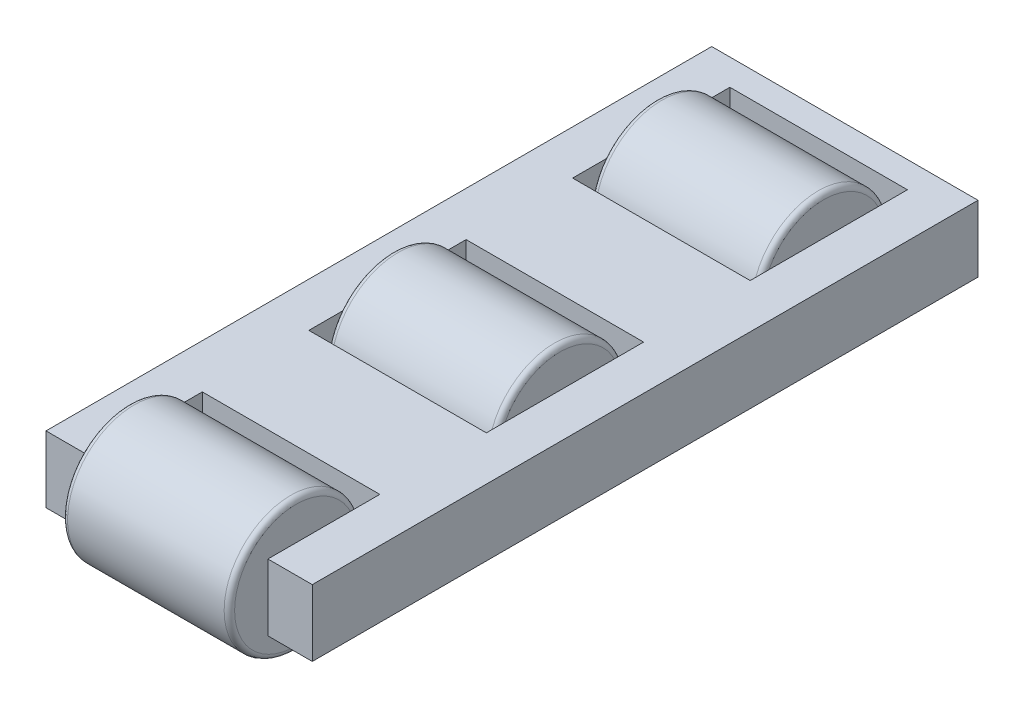
ISO-10303-21;
HEADER;
FILE_DESCRIPTION(('STEP AP214'),'2;1');
FILE_NAME('part.step','',(''),(''),'','','');
FILE_SCHEMA(('AUTOMOTIVE_DESIGN { 1 0 10303 214 1 1 1 1 }'));
ENDSEC;
DATA;
#1=APPLICATION_CONTEXT('core data for automotive mechanical design processes');
#2=APPLICATION_PROTOCOL_DEFINITION('international standard','automotive_design',2000,#1);
#3=PRODUCT_CONTEXT('',#1,'mechanical');
#4=PRODUCT('Part','Part','',(#3));
#5=PRODUCT_RELATED_PRODUCT_CATEGORY('part','',(#4));
#6=PRODUCT_DEFINITION_FORMATION('','',#4);
#7=PRODUCT_DEFINITION_CONTEXT('part definition',#1,'design');
#8=PRODUCT_DEFINITION('design','',#6,#7);
#9=PRODUCT_DEFINITION_SHAPE('','',#8);
#10=(LENGTH_UNIT() NAMED_UNIT(*) SI_UNIT(.MILLI.,.METRE.));
#11=(NAMED_UNIT(*) PLANE_ANGLE_UNIT() SI_UNIT($,.RADIAN.));
#12=(NAMED_UNIT(*) SI_UNIT($,.STERADIAN.) SOLID_ANGLE_UNIT());
#13=UNCERTAINTY_MEASURE_WITH_UNIT(LENGTH_MEASURE(1.E-05),#10,'distance_accuracy_value','');
#14=(GEOMETRIC_REPRESENTATION_CONTEXT(3) GLOBAL_UNCERTAINTY_ASSIGNED_CONTEXT((#13)) GLOBAL_UNIT_ASSIGNED_CONTEXT((#10,
#11,#12)) REPRESENTATION_CONTEXT('',''));
#15=CARTESIAN_POINT('',(0.,0.,0.));
#16=DIRECTION('',(0.,0.,1.));
#17=DIRECTION('',(1.,0.,0.));
#18=AXIS2_PLACEMENT_3D('',#15,#16,#17);
#19=CARTESIAN_POINT('',(15.9333333333333,6.35,57.15));
#20=DIRECTION('',(-1.,0.,0.));
#21=DIRECTION('',(0.,0.,1.));
#22=AXIS2_PLACEMENT_3D('',#19,#20,#21);
#23=PLANE('',#22);
#24=CARTESIAN_POINT('',(15.9333333333333,6.35,57.15));
#25=DIRECTION('',(-1.,0.,0.));
#26=DIRECTION('',(0.,0.,1.));
#27=AXIS2_PLACEMENT_3D('',#24,#25,#26);
#28=CIRCLE('',#27,11.7);
#29=CARTESIAN_POINT('',(15.9333333333333,6.35,68.85));
#30=VERTEX_POINT('',#29);
#31=EDGE_CURVE('E50',#30,#30,#28,.F.);
#32=ORIENTED_EDGE('',*,*,#31,.T.);
#33=EDGE_LOOP('',(#32));
#34=FACE_BOUND('',#33,.T.);
#35=ADVANCED_FACE('F43',(#34),#23,.F.);
#36=CARTESIAN_POINT('',(-51.85435781761,6.35,57.15));
#37=DIRECTION('',(1.,0.,0.));
#38=DIRECTION('',(0.,0.,-1.));
#39=AXIS2_PLACEMENT_3D('',#36,#37,#38);
#40=CYLINDRICAL_SURFACE('',#39,12.7);
#41=CARTESIAN_POINT('',(14.9333333333333,6.35,57.15));
#42=DIRECTION('',(-1.,0.,0.));
#43=DIRECTION('',(0.,0.,1.));
#44=AXIS2_PLACEMENT_3D('',#41,#42,#43);
#45=CIRCLE('',#44,12.7);
#46=CARTESIAN_POINT('',(14.9333333333333,6.35,69.85));
#47=VERTEX_POINT('',#46);
#48=EDGE_CURVE('E54',#47,#47,#45,.T.);
#49=ORIENTED_EDGE('',*,*,#48,.T.);
#50=EDGE_LOOP('',(#49));
#51=FACE_BOUND('',#50,.T.);
#52=CARTESIAN_POINT('',(-14.9333333333333,6.35,57.15));
#53=DIRECTION('',(1.,0.,0.));
#54=DIRECTION('',(0.,0.,-1.));
#55=AXIS2_PLACEMENT_3D('',#52,#53,#54);
#56=CIRCLE('',#55,12.7);
#57=CARTESIAN_POINT('',(-14.9333333333333,6.35,44.45));
#58=VERTEX_POINT('',#57);
#59=EDGE_CURVE('E58',#58,#58,#56,.T.);
#60=ORIENTED_EDGE('',*,*,#59,.T.);
#61=EDGE_LOOP('',(#60));
#62=FACE_BOUND('',#61,.T.);
#63=ADVANCED_FACE('F64',(#51,#62),#40,.T.);
#64=CARTESIAN_POINT('',(-15.9333333333333,0.,0.));
#65=DIRECTION('',(1.,0.,0.));
#66=DIRECTION('',(0.,0.,-1.));
#67=AXIS2_PLACEMENT_3D('',#64,#65,#66);
#68=PLANE('',#67);
#69=CARTESIAN_POINT('',(-15.9333333333333,6.35,57.15));
#70=DIRECTION('',(1.,0.,0.));
#71=DIRECTION('',(0.,0.,-1.));
#72=AXIS2_PLACEMENT_3D('',#69,#70,#71);
#73=CIRCLE('',#72,11.7);
#74=CARTESIAN_POINT('',(-15.9333333333333,6.35,45.45));
#75=VERTEX_POINT('',#74);
#76=EDGE_CURVE('E11',#75,#75,#73,.F.);
#77=ORIENTED_EDGE('',*,*,#76,.T.);
#78=EDGE_LOOP('',(#77));
#79=FACE_BOUND('',#78,.T.);
#80=ADVANCED_FACE('F72',(#79),#68,.F.);
#81=CARTESIAN_POINT('',(14.9333333333333,6.35,57.15));
#82=DIRECTION('',(-1.,0.,0.));
#83=DIRECTION('',(0.,0.,1.));
#84=AXIS2_PLACEMENT_3D('',#81,#82,#83);
#85=TOROIDAL_SURFACE('',#84,11.7,1.);
#86=ORIENTED_EDGE('',*,*,#31,.F.);
#87=EDGE_LOOP('',(#86));
#88=FACE_BOUND('',#87,.T.);
#89=ORIENTED_EDGE('',*,*,#48,.F.);
#90=EDGE_LOOP('',(#89));
#91=FACE_BOUND('',#90,.T.);
#92=ADVANCED_FACE('F67',(#88,#91),#85,.T.);
#93=CARTESIAN_POINT('',(-14.9333333333333,6.35,57.15));
#94=DIRECTION('',(1.,0.,0.));
#95=DIRECTION('',(0.,0.,-1.));
#96=AXIS2_PLACEMENT_3D('',#93,#94,#95);
#97=TOROIDAL_SURFACE('',#96,11.7,1.);
#98=ORIENTED_EDGE('',*,*,#76,.F.);
#99=EDGE_LOOP('',(#98));
#100=FACE_BOUND('',#99,.T.);
#101=ORIENTED_EDGE('',*,*,#59,.F.);
#102=EDGE_LOOP('',(#101));
#103=FACE_BOUND('',#102,.T.);
#104=ADVANCED_FACE('F45',(#100,#103),#97,.T.);
#105=CLOSED_SHELL('',(#35,#63,#80,#92,#104));
#106=MANIFOLD_SOLID_BREP('B2',#105);
#107=CARTESIAN_POINT('',(15.9333333333333,6.35,-43.5));
#108=DIRECTION('',(-1.,0.,0.));
#109=DIRECTION('',(0.,0.,1.));
#110=AXIS2_PLACEMENT_3D('',#107,#108,#109);
#111=PLANE('',#110);
#112=CARTESIAN_POINT('',(15.9333333333333,6.35,-43.5));
#113=DIRECTION('',(-1.,0.,0.));
#114=DIRECTION('',(0.,0.,1.));
#115=AXIS2_PLACEMENT_3D('',#112,#113,#114);
#116=CIRCLE('',#115,11.7);
#117=CARTESIAN_POINT('',(15.9333333333333,6.35,-31.8));
#118=VERTEX_POINT('',#117);
#119=EDGE_CURVE('E128',#118,#118,#116,.F.);
#120=ORIENTED_EDGE('',*,*,#119,.T.);
#121=EDGE_LOOP('',(#120));
#122=FACE_BOUND('',#121,.T.);
#123=ADVANCED_FACE('F121',(#122),#111,.F.);
#124=CARTESIAN_POINT('',(-51.85435781761,6.35,-43.5));
#125=DIRECTION('',(1.,0.,0.));
#126=DIRECTION('',(0.,0.,-1.));
#127=AXIS2_PLACEMENT_3D('',#124,#125,#126);
#128=CYLINDRICAL_SURFACE('',#127,12.7);
#129=CARTESIAN_POINT('',(14.9333333333333,6.35,-43.5));
#130=DIRECTION('',(-1.,0.,0.));
#131=DIRECTION('',(0.,0.,1.));
#132=AXIS2_PLACEMENT_3D('',#129,#130,#131);
#133=CIRCLE('',#132,12.7);
#134=CARTESIAN_POINT('',(14.9333333333333,6.35,-30.8));
#135=VERTEX_POINT('',#134);
#136=EDGE_CURVE('E132',#135,#135,#133,.T.);
#137=ORIENTED_EDGE('',*,*,#136,.T.);
#138=EDGE_LOOP('',(#137));
#139=FACE_BOUND('',#138,.T.);
#140=CARTESIAN_POINT('',(-14.9333333333333,6.35,-43.5));
#141=DIRECTION('',(1.,0.,0.));
#142=DIRECTION('',(0.,0.,-1.));
#143=AXIS2_PLACEMENT_3D('',#140,#141,#142);
#144=CIRCLE('',#143,12.7);
#145=CARTESIAN_POINT('',(-14.9333333333333,6.35,-56.2));
#146=VERTEX_POINT('',#145);
#147=EDGE_CURVE('E136',#146,#146,#144,.T.);
#148=ORIENTED_EDGE('',*,*,#147,.T.);
#149=EDGE_LOOP('',(#148));
#150=FACE_BOUND('',#149,.T.);
#151=ADVANCED_FACE('F142',(#139,#150),#128,.T.);
#152=CARTESIAN_POINT('',(-15.9333333333333,0.,0.));
#153=DIRECTION('',(1.,0.,0.));
#154=DIRECTION('',(0.,0.,-1.));
#155=AXIS2_PLACEMENT_3D('',#152,#153,#154);
#156=PLANE('',#155);
#157=CARTESIAN_POINT('',(-15.9333333333333,6.35,-43.5));
#158=DIRECTION('',(1.,0.,0.));
#159=DIRECTION('',(0.,0.,-1.));
#160=AXIS2_PLACEMENT_3D('',#157,#158,#159);
#161=CIRCLE('',#160,11.7);
#162=CARTESIAN_POINT('',(-15.9333333333333,6.35,-55.2));
#163=VERTEX_POINT('',#162);
#164=EDGE_CURVE('E42',#163,#163,#161,.F.);
#165=ORIENTED_EDGE('',*,*,#164,.T.);
#166=EDGE_LOOP('',(#165));
#167=FACE_BOUND('',#166,.T.);
#168=ADVANCED_FACE('F150',(#167),#156,.F.);
#169=CARTESIAN_POINT('',(14.9333333333333,6.35,-43.5));
#170=DIRECTION('',(-1.,0.,0.));
#171=DIRECTION('',(0.,0.,1.));
#172=AXIS2_PLACEMENT_3D('',#169,#170,#171);
#173=TOROIDAL_SURFACE('',#172,11.7,1.);
#174=ORIENTED_EDGE('',*,*,#119,.F.);
#175=EDGE_LOOP('',(#174));
#176=FACE_BOUND('',#175,.T.);
#177=ORIENTED_EDGE('',*,*,#136,.F.);
#178=EDGE_LOOP('',(#177));
#179=FACE_BOUND('',#178,.T.);
#180=ADVANCED_FACE('F145',(#176,#179),#173,.T.);
#181=CARTESIAN_POINT('',(-14.9333333333333,6.35,-43.5));
#182=DIRECTION('',(1.,0.,0.));
#183=DIRECTION('',(0.,0.,-1.));
#184=AXIS2_PLACEMENT_3D('',#181,#182,#183);
#185=TOROIDAL_SURFACE('',#184,11.7,1.);
#186=ORIENTED_EDGE('',*,*,#164,.F.);
#187=EDGE_LOOP('',(#186));
#188=FACE_BOUND('',#187,.T.);
#189=ORIENTED_EDGE('',*,*,#147,.F.);
#190=EDGE_LOOP('',(#189));
#191=FACE_BOUND('',#190,.T.);
#192=ADVANCED_FACE('F123',(#188,#191),#185,.T.);
#193=CLOSED_SHELL('',(#123,#151,#168,#180,#192));
#194=MANIFOLD_SOLID_BREP('B6',#193);
#195=CARTESIAN_POINT('',(15.9333333333333,6.35,6.825));
#196=DIRECTION('',(-1.,0.,0.));
#197=DIRECTION('',(0.,0.,1.));
#198=AXIS2_PLACEMENT_3D('',#195,#196,#197);
#199=PLANE('',#198);
#200=CARTESIAN_POINT('',(15.9333333333333,6.35,6.825));
#201=DIRECTION('',(-1.,0.,0.));
#202=DIRECTION('',(0.,0.,1.));
#203=AXIS2_PLACEMENT_3D('',#200,#201,#202);
#204=CIRCLE('',#203,11.7);
#205=CARTESIAN_POINT('',(15.9333333333333,6.35,18.525));
#206=VERTEX_POINT('',#205);
#207=EDGE_CURVE('E120',#206,#206,#204,.F.);
#208=ORIENTED_EDGE('',*,*,#207,.T.);
#209=EDGE_LOOP('',(#208));
#210=FACE_BOUND('',#209,.T.);
#211=ADVANCED_FACE('F200',(#210),#199,.F.);
#212=CARTESIAN_POINT('',(-51.85435781761,6.35,6.825));
#213=DIRECTION('',(1.,0.,0.));
#214=DIRECTION('',(0.,0.,-1.));
#215=AXIS2_PLACEMENT_3D('',#212,#213,#214);
#216=CYLINDRICAL_SURFACE('',#215,12.7);
#217=CARTESIAN_POINT('',(-14.9333333333333,6.35,6.825));
#218=DIRECTION('',(1.,0.,0.));
#219=DIRECTION('',(0.,0.,-1.));
#220=AXIS2_PLACEMENT_3D('',#217,#218,#219);
#221=CIRCLE('',#220,12.7);
#222=CARTESIAN_POINT('',(-14.9333333333333,6.35,-5.875));
#223=VERTEX_POINT('',#222);
#224=EDGE_CURVE('E211',#223,#223,#221,.T.);
#225=ORIENTED_EDGE('',*,*,#224,.T.);
#226=EDGE_LOOP('',(#225));
#227=FACE_BOUND('',#226,.T.);
#228=CARTESIAN_POINT('',(14.9333333333333,6.35,6.825));
#229=DIRECTION('',(-1.,0.,0.));
#230=DIRECTION('',(0.,0.,1.));
#231=AXIS2_PLACEMENT_3D('',#228,#229,#230);
#232=CIRCLE('',#231,12.7);
#233=CARTESIAN_POINT('',(14.9333333333333,6.35,19.525));
#234=VERTEX_POINT('',#233);
#235=EDGE_CURVE('E215',#234,#234,#232,.T.);
#236=ORIENTED_EDGE('',*,*,#235,.T.);
#237=EDGE_LOOP('',(#236));
#238=FACE_BOUND('',#237,.T.);
#239=ADVANCED_FACE('F221',(#227,#238),#216,.T.);
#240=CARTESIAN_POINT('',(-15.9333333333333,0.,0.));
#241=DIRECTION('',(1.,0.,0.));
#242=DIRECTION('',(0.,0.,-1.));
#243=AXIS2_PLACEMENT_3D('',#240,#241,#242);
#244=PLANE('',#243);
#245=CARTESIAN_POINT('',(-15.9333333333333,6.35,6.825));
#246=DIRECTION('',(1.,0.,0.));
#247=DIRECTION('',(0.,0.,-1.));
#248=AXIS2_PLACEMENT_3D('',#245,#246,#247);
#249=CIRCLE('',#248,11.7);
#250=CARTESIAN_POINT('',(-15.9333333333333,6.35,-4.875));
#251=VERTEX_POINT('',#250);
#252=EDGE_CURVE('E207',#251,#251,#249,.F.);
#253=ORIENTED_EDGE('',*,*,#252,.T.);
#254=EDGE_LOOP('',(#253));
#255=FACE_BOUND('',#254,.T.);
#256=ADVANCED_FACE('F229',(#255),#244,.F.);
#257=CARTESIAN_POINT('',(-14.9333333333333,6.35,6.825));
#258=DIRECTION('',(1.,0.,0.));
#259=DIRECTION('',(0.,0.,-1.));
#260=AXIS2_PLACEMENT_3D('',#257,#258,#259);
#261=TOROIDAL_SURFACE('',#260,11.7,1.);
#262=ORIENTED_EDGE('',*,*,#252,.F.);
#263=EDGE_LOOP('',(#262));
#264=FACE_BOUND('',#263,.T.);
#265=ORIENTED_EDGE('',*,*,#224,.F.);
#266=EDGE_LOOP('',(#265));
#267=FACE_BOUND('',#266,.T.);
#268=ADVANCED_FACE('F224',(#264,#267),#261,.T.);
#269=CARTESIAN_POINT('',(14.9333333333333,6.35,6.825));
#270=DIRECTION('',(-1.,0.,0.));
#271=DIRECTION('',(0.,0.,1.));
#272=AXIS2_PLACEMENT_3D('',#269,#270,#271);
#273=TOROIDAL_SURFACE('',#272,11.7,1.);
#274=ORIENTED_EDGE('',*,*,#207,.F.);
#275=EDGE_LOOP('',(#274));
#276=FACE_BOUND('',#275,.T.);
#277=ORIENTED_EDGE('',*,*,#235,.F.);
#278=EDGE_LOOP('',(#277));
#279=FACE_BOUND('',#278,.T.);
#280=ADVANCED_FACE('F202',(#276,#279),#273,.T.);
#281=CLOSED_SHELL('',(#211,#239,#256,#268,#280));
#282=MANIFOLD_SOLID_BREP('B37',#281);
#283=CARTESIAN_POINT('',(-25.4,12.7,63.5));
#284=DIRECTION('',(0.,0.,-1.));
#285=DIRECTION('',(-1.,0.,0.));
#286=AXIS2_PLACEMENT_3D('',#283,#284,#285);
#287=PLANE('',#286);
#288=DIRECTION('',(1.,0.,0.));
#289=VECTOR('',#288,1.);
#290=CARTESIAN_POINT('',(-25.4,12.7,63.5));
#291=LINE('',#290,#289);
#292=CARTESIAN_POINT('',(16.9333333333333,12.7,63.5));
#293=VERTEX_POINT('',#292);
#294=CARTESIAN_POINT('',(25.4,12.7,63.5));
#295=VERTEX_POINT('',#294);
#296=EDGE_CURVE('E488',#293,#295,#291,.T.);
#297=ORIENTED_EDGE('',*,*,#296,.F.);
#298=DIRECTION('',(0.,1.,0.));
#299=VECTOR('',#298,1.);
#300=CARTESIAN_POINT('',(16.9333333333333,-45.243243817294,63.5));
#301=LINE('',#300,#299);
#302=CARTESIAN_POINT('',(16.9333333333333,0.,63.5));
#303=VERTEX_POINT('',#302);
#304=EDGE_CURVE('E475',#303,#293,#301,.T.);
#305=ORIENTED_EDGE('',*,*,#304,.F.);
#306=DIRECTION('',(1.,0.,0.));
#307=VECTOR('',#306,1.);
#308=CARTESIAN_POINT('',(-25.4,0.,63.5));
#309=LINE('',#308,#307);
#310=CARTESIAN_POINT('',(25.4,0.,63.5));
#311=VERTEX_POINT('',#310);
#312=EDGE_CURVE('E499',#303,#311,#309,.T.);
#313=ORIENTED_EDGE('',*,*,#312,.T.);
#314=DIRECTION('',(0.,-1.,0.));
#315=VECTOR('',#314,1.);
#316=CARTESIAN_POINT('',(25.4,12.7,63.5));
#317=LINE('',#316,#315);
#318=EDGE_CURVE('E492',#295,#311,#317,.T.);
#319=ORIENTED_EDGE('',*,*,#318,.F.);
#320=EDGE_LOOP('',(#297,#305,#313,#319));
#321=FACE_BOUND('',#320,.T.);
#322=ADVANCED_FACE('F270',(#321),#287,.F.);
#323=CARTESIAN_POINT('',(25.4,12.7,63.5));
#324=DIRECTION('',(-1.,0.,0.));
#325=DIRECTION('',(0.,0.,1.));
#326=AXIS2_PLACEMENT_3D('',#323,#324,#325);
#327=PLANE('',#326);
#328=DIRECTION('',(0.,0.,-1.));
#329=VECTOR('',#328,1.);
#330=CARTESIAN_POINT('',(25.4,0.,63.5));
#331=LINE('',#330,#329);
#332=CARTESIAN_POINT('',(25.4,0.,-63.5));
#333=VERTEX_POINT('',#332);
#334=EDGE_CURVE('E479',#311,#333,#331,.T.);
#335=ORIENTED_EDGE('',*,*,#334,.T.);
#336=DIRECTION('',(0.,-1.,0.));
#337=VECTOR('',#336,1.);
#338=CARTESIAN_POINT('',(25.4,12.7,-63.5));
#339=LINE('',#338,#337);
#340=CARTESIAN_POINT('',(25.4,12.7,-63.5));
#341=VERTEX_POINT('',#340);
#342=EDGE_CURVE('E198',#341,#333,#339,.T.);
#343=ORIENTED_EDGE('',*,*,#342,.F.);
#344=DIRECTION('',(0.,0.,-1.));
#345=VECTOR('',#344,1.);
#346=CARTESIAN_POINT('',(25.4,12.7,63.5));
#347=LINE('',#346,#345);
#348=EDGE_CURVE('E480',#295,#341,#347,.T.);
#349=ORIENTED_EDGE('',*,*,#348,.F.);
#350=ORIENTED_EDGE('',*,*,#318,.T.);
#351=EDGE_LOOP('',(#335,#343,#349,#350));
#352=FACE_BOUND('',#351,.T.);
#353=ADVANCED_FACE('F272',(#352),#327,.F.);
#354=CARTESIAN_POINT('',(-25.4,12.7,-63.5));
#355=DIRECTION('',(0.,0.,1.));
#356=DIRECTION('',(1.,0.,0.));
#357=AXIS2_PLACEMENT_3D('',#354,#355,#356);
#358=PLANE('',#357);
#359=DIRECTION('',(-1.,0.,0.));
#360=VECTOR('',#359,1.);
#361=CARTESIAN_POINT('',(-25.4,0.,-63.5));
#362=LINE('',#361,#360);
#363=CARTESIAN_POINT('',(-25.4,0.,-63.5));
#364=VERTEX_POINT('',#363);
#365=EDGE_CURVE('E495',#333,#364,#362,.T.);
#366=ORIENTED_EDGE('',*,*,#365,.T.);
#367=DIRECTION('',(0.,-1.,0.));
#368=VECTOR('',#367,1.);
#369=CARTESIAN_POINT('',(-25.4,12.7,-63.5));
#370=LINE('',#369,#368);
#371=CARTESIAN_POINT('',(-25.4,12.7,-63.5));
#372=VERTEX_POINT('',#371);
#373=EDGE_CURVE('E278',#372,#364,#370,.T.);
#374=ORIENTED_EDGE('',*,*,#373,.F.);
#375=DIRECTION('',(-1.,0.,0.));
#376=VECTOR('',#375,1.);
#377=CARTESIAN_POINT('',(-25.4,12.7,-63.5));
#378=LINE('',#377,#376);
#379=EDGE_CURVE('E483',#341,#372,#378,.T.);
#380=ORIENTED_EDGE('',*,*,#379,.F.);
#381=ORIENTED_EDGE('',*,*,#342,.T.);
#382=EDGE_LOOP('',(#366,#374,#380,#381));
#383=FACE_BOUND('',#382,.T.);
#384=ADVANCED_FACE('F526',(#383),#358,.F.);
#385=CARTESIAN_POINT('',(-25.4,12.7,63.5));
#386=DIRECTION('',(1.,0.,0.));
#387=DIRECTION('',(0.,0.,-1.));
#388=AXIS2_PLACEMENT_3D('',#385,#386,#387);
#389=PLANE('',#388);
#390=DIRECTION('',(0.,0.,1.));
#391=VECTOR('',#390,1.);
#392=CARTESIAN_POINT('',(-25.4,0.,63.5));
#393=LINE('',#392,#391);
#394=CARTESIAN_POINT('',(-25.4,0.,63.5));
#395=VERTEX_POINT('',#394);
#396=EDGE_CURVE('E497',#364,#395,#393,.T.);
#397=ORIENTED_EDGE('',*,*,#396,.T.);
#398=DIRECTION('',(0.,-1.,0.));
#399=VECTOR('',#398,1.);
#400=CARTESIAN_POINT('',(-25.4,12.7,63.5));
#401=LINE('',#400,#399);
#402=CARTESIAN_POINT('',(-25.4,12.7,63.5));
#403=VERTEX_POINT('',#402);
#404=EDGE_CURVE('E504',#403,#395,#401,.T.);
#405=ORIENTED_EDGE('',*,*,#404,.F.);
#406=DIRECTION('',(0.,0.,1.));
#407=VECTOR('',#406,1.);
#408=CARTESIAN_POINT('',(-25.4,12.7,63.5));
#409=LINE('',#408,#407);
#410=EDGE_CURVE('E486',#372,#403,#409,.T.);
#411=ORIENTED_EDGE('',*,*,#410,.F.);
#412=ORIENTED_EDGE('',*,*,#373,.T.);
#413=EDGE_LOOP('',(#397,#405,#411,#412));
#414=FACE_BOUND('',#413,.T.);
#415=ADVANCED_FACE('F511',(#414),#389,.F.);
#416=CARTESIAN_POINT('',(-16.9333333333333,0.,63.5));
#417=VERTEX_POINT('',#416);
#418=EDGE_CURVE('E484',#395,#417,#309,.T.);
#419=ORIENTED_EDGE('',*,*,#418,.T.);
#420=DIRECTION('',(0.,1.,0.));
#421=VECTOR('',#420,1.);
#422=CARTESIAN_POINT('',(-16.9333333333333,-45.243243817294,63.5));
#423=LINE('',#422,#421);
#424=CARTESIAN_POINT('',(-16.9333333333333,12.7,63.5));
#425=VERTEX_POINT('',#424);
#426=EDGE_CURVE('E468',#417,#425,#423,.T.);
#427=ORIENTED_EDGE('',*,*,#426,.T.);
#428=EDGE_CURVE('E489',#403,#425,#291,.T.);
#429=ORIENTED_EDGE('',*,*,#428,.F.);
#430=ORIENTED_EDGE('',*,*,#404,.T.);
#431=EDGE_LOOP('',(#419,#427,#429,#430));
#432=FACE_BOUND('',#431,.T.);
#433=ADVANCED_FACE('F518',(#432),#287,.F.);
#434=CARTESIAN_POINT('',(0.,12.7,0.));
#435=DIRECTION('',(0.,-1.,0.));
#436=DIRECTION('',(0.,0.,-1.));
#437=AXIS2_PLACEMENT_3D('',#434,#435,#436);
#438=PLANE('',#437);
#439=DIRECTION('',(0.,0.,-1.));
#440=VECTOR('',#439,1.);
#441=CARTESIAN_POINT('',(16.9333333333333,12.7,-8.175));
#442=LINE('',#441,#440);
#443=CARTESIAN_POINT('',(16.9333333333333,12.7,21.825));
#444=VERTEX_POINT('',#443);
#445=CARTESIAN_POINT('',(16.9333333333333,12.7,-8.175));
#446=VERTEX_POINT('',#445);
#447=EDGE_CURVE('E409',#444,#446,#442,.T.);
#448=ORIENTED_EDGE('',*,*,#447,.F.);
#449=DIRECTION('',(1.,0.,0.));
#450=VECTOR('',#449,1.);
#451=CARTESIAN_POINT('',(-16.9333333333333,12.7,21.825));
#452=LINE('',#451,#450);
#453=CARTESIAN_POINT('',(-16.9333333333333,12.7,21.825));
#454=VERTEX_POINT('',#453);
#455=EDGE_CURVE('E402',#454,#444,#452,.T.);
#456=ORIENTED_EDGE('',*,*,#455,.F.);
#457=DIRECTION('',(0.,0.,1.));
#458=VECTOR('',#457,1.);
#459=CARTESIAN_POINT('',(-16.9333333333333,12.7,-8.175));
#460=LINE('',#459,#458);
#461=CARTESIAN_POINT('',(-16.9333333333333,12.7,-8.175));
#462=VERTEX_POINT('',#461);
#463=EDGE_CURVE('E413',#462,#454,#460,.T.);
#464=ORIENTED_EDGE('',*,*,#463,.F.);
#465=DIRECTION('',(-1.,0.,0.));
#466=VECTOR('',#465,1.);
#467=CARTESIAN_POINT('',(-16.9333333333333,12.7,-8.175));
#468=LINE('',#467,#466);
#469=EDGE_CURVE('E285',#446,#462,#468,.T.);
#470=ORIENTED_EDGE('',*,*,#469,.F.);
#471=EDGE_LOOP('',(#448,#456,#464,#470));
#472=FACE_BOUND('',#471,.T.);
#473=DIRECTION('',(0.,0.,1.));
#474=VECTOR('',#473,1.);
#475=CARTESIAN_POINT('',(-16.9333333333333,12.7,-28.5));
#476=LINE('',#475,#474);
#477=CARTESIAN_POINT('',(-16.9333333333333,12.7,-58.5));
#478=VERTEX_POINT('',#477);
#479=CARTESIAN_POINT('',(-16.9333333333333,12.7,-28.5));
#480=VERTEX_POINT('',#479);
#481=EDGE_CURVE('E426',#478,#480,#476,.T.);
#482=ORIENTED_EDGE('',*,*,#481,.F.);
#483=DIRECTION('',(-1.,0.,0.));
#484=VECTOR('',#483,1.);
#485=CARTESIAN_POINT('',(16.9333333333333,12.7,-58.5));
#486=LINE('',#485,#484);
#487=CARTESIAN_POINT('',(16.9333333333333,12.7,-58.5));
#488=VERTEX_POINT('',#487);
#489=EDGE_CURVE('E429',#488,#478,#486,.T.);
#490=ORIENTED_EDGE('',*,*,#489,.F.);
#491=DIRECTION('',(0.,0.,-1.));
#492=VECTOR('',#491,1.);
#493=CARTESIAN_POINT('',(16.9333333333333,12.7,-28.5));
#494=LINE('',#493,#492);
#495=CARTESIAN_POINT('',(16.9333333333333,12.7,-28.5));
#496=VERTEX_POINT('',#495);
#497=EDGE_CURVE('E432',#496,#488,#494,.T.);
#498=ORIENTED_EDGE('',*,*,#497,.F.);
#499=DIRECTION('',(1.,0.,0.));
#500=VECTOR('',#499,1.);
#501=CARTESIAN_POINT('',(16.9333333333333,12.7,-28.5));
#502=LINE('',#501,#500);
#503=EDGE_CURVE('E293',#480,#496,#502,.T.);
#504=ORIENTED_EDGE('',*,*,#503,.F.);
#505=EDGE_LOOP('',(#482,#490,#498,#504));
#506=FACE_BOUND('',#505,.T.);
#507=DIRECTION('',(-1.,0.,0.));
#508=VECTOR('',#507,1.);
#509=CARTESIAN_POINT('',(16.9333333333333,12.7,42.15));
#510=LINE('',#509,#508);
#511=CARTESIAN_POINT('',(16.9333333333333,12.7,42.15));
#512=VERTEX_POINT('',#511);
#513=CARTESIAN_POINT('',(-16.9333333333333,12.7,42.15));
#514=VERTEX_POINT('',#513);
#515=EDGE_CURVE('E457',#512,#514,#510,.T.);
#516=ORIENTED_EDGE('',*,*,#515,.F.);
#517=DIRECTION('',(0.,0.,-1.));
#518=VECTOR('',#517,1.);
#519=CARTESIAN_POINT('',(16.9333333333333,12.7,63.5));
#520=LINE('',#519,#518);
#521=EDGE_CURVE('E423',#293,#512,#520,.T.);
#522=ORIENTED_EDGE('',*,*,#521,.F.);
#523=ORIENTED_EDGE('',*,*,#296,.T.);
#524=ORIENTED_EDGE('',*,*,#348,.T.);
#525=ORIENTED_EDGE('',*,*,#379,.T.);
#526=ORIENTED_EDGE('',*,*,#410,.T.);
#527=ORIENTED_EDGE('',*,*,#428,.T.);
#528=DIRECTION('',(0.,0.,1.));
#529=VECTOR('',#528,1.);
#530=CARTESIAN_POINT('',(-16.9333333333333,12.7,63.5));
#531=LINE('',#530,#529);
#532=EDGE_CURVE('E454',#514,#425,#531,.T.);
#533=ORIENTED_EDGE('',*,*,#532,.F.);
#534=EDGE_LOOP('',(#516,#522,#523,#524,#525,#526,#527,#533));
#535=FACE_BOUND('',#534,.T.);
#536=ADVANCED_FACE('F523',(#472,#506,#535),#438,.F.);
#537=CARTESIAN_POINT('',(0.,0.,0.));
#538=DIRECTION('',(0.,-1.,0.));
#539=DIRECTION('',(0.,0.,-1.));
#540=AXIS2_PLACEMENT_3D('',#537,#538,#539);
#541=PLANE('',#540);
#542=DIRECTION('',(1.,0.,0.));
#543=VECTOR('',#542,1.);
#544=CARTESIAN_POINT('',(-16.9333333333333,0.,21.825));
#545=LINE('',#544,#543);
#546=CARTESIAN_POINT('',(-16.9333333333333,0.,21.825));
#547=VERTEX_POINT('',#546);
#548=CARTESIAN_POINT('',(16.9333333333333,0.,21.825));
#549=VERTEX_POINT('',#548);
#550=EDGE_CURVE('E399',#547,#549,#545,.T.);
#551=ORIENTED_EDGE('',*,*,#550,.T.);
#552=DIRECTION('',(0.,0.,-1.));
#553=VECTOR('',#552,1.);
#554=CARTESIAN_POINT('',(16.9333333333333,0.,-8.175));
#555=LINE('',#554,#553);
#556=CARTESIAN_POINT('',(16.9333333333333,0.,-8.175));
#557=VERTEX_POINT('',#556);
#558=EDGE_CURVE('E385',#549,#557,#555,.T.);
#559=ORIENTED_EDGE('',*,*,#558,.T.);
#560=DIRECTION('',(-1.,0.,0.));
#561=VECTOR('',#560,1.);
#562=CARTESIAN_POINT('',(-16.9333333333333,0.,-8.175));
#563=LINE('',#562,#561);
#564=CARTESIAN_POINT('',(-16.9333333333333,0.,-8.175));
#565=VERTEX_POINT('',#564);
#566=EDGE_CURVE('E418',#557,#565,#563,.T.);
#567=ORIENTED_EDGE('',*,*,#566,.T.);
#568=DIRECTION('',(0.,0.,1.));
#569=VECTOR('',#568,1.);
#570=CARTESIAN_POINT('',(-16.9333333333333,0.,-8.175));
#571=LINE('',#570,#569);
#572=EDGE_CURVE('E407',#565,#547,#571,.T.);
#573=ORIENTED_EDGE('',*,*,#572,.T.);
#574=EDGE_LOOP('',(#551,#559,#567,#573));
#575=FACE_BOUND('',#574,.T.);
#576=DIRECTION('',(-1.,0.,0.));
#577=VECTOR('',#576,1.);
#578=CARTESIAN_POINT('',(16.9333333333333,0.,-58.5));
#579=LINE('',#578,#577);
#580=CARTESIAN_POINT('',(16.9333333333333,0.,-58.5));
#581=VERTEX_POINT('',#580);
#582=CARTESIAN_POINT('',(-16.9333333333333,0.,-58.5));
#583=VERTEX_POINT('',#582);
#584=EDGE_CURVE('E425',#581,#583,#579,.T.);
#585=ORIENTED_EDGE('',*,*,#584,.T.);
#586=DIRECTION('',(0.,0.,1.));
#587=VECTOR('',#586,1.);
#588=CARTESIAN_POINT('',(-16.9333333333333,0.,-28.5));
#589=LINE('',#588,#587);
#590=CARTESIAN_POINT('',(-16.9333333333333,0.,-28.5));
#591=VERTEX_POINT('',#590);
#592=EDGE_CURVE('E447',#583,#591,#589,.T.);
#593=ORIENTED_EDGE('',*,*,#592,.T.);
#594=DIRECTION('',(1.,0.,0.));
#595=VECTOR('',#594,1.);
#596=CARTESIAN_POINT('',(16.9333333333333,0.,-28.5));
#597=LINE('',#596,#595);
#598=CARTESIAN_POINT('',(16.9333333333333,0.,-28.5));
#599=VERTEX_POINT('',#598);
#600=EDGE_CURVE('E443',#591,#599,#597,.T.);
#601=ORIENTED_EDGE('',*,*,#600,.T.);
#602=DIRECTION('',(0.,0.,-1.));
#603=VECTOR('',#602,1.);
#604=CARTESIAN_POINT('',(16.9333333333333,0.,-28.5));
#605=LINE('',#604,#603);
#606=EDGE_CURVE('E438',#599,#581,#605,.T.);
#607=ORIENTED_EDGE('',*,*,#606,.T.);
#608=EDGE_LOOP('',(#585,#593,#601,#607));
#609=FACE_BOUND('',#608,.T.);
#610=DIRECTION('',(0.,0.,-1.));
#611=VECTOR('',#610,1.);
#612=CARTESIAN_POINT('',(16.9333333333333,0.,63.5));
#613=LINE('',#612,#611);
#614=CARTESIAN_POINT('',(16.9333333333333,0.,42.15));
#615=VERTEX_POINT('',#614);
#616=EDGE_CURVE('E456',#303,#615,#613,.T.);
#617=ORIENTED_EDGE('',*,*,#616,.T.);
#618=DIRECTION('',(-1.,0.,0.));
#619=VECTOR('',#618,1.);
#620=CARTESIAN_POINT('',(16.9333333333333,0.,42.15));
#621=LINE('',#620,#619);
#622=CARTESIAN_POINT('',(-16.9333333333333,0.,42.15));
#623=VERTEX_POINT('',#622);
#624=EDGE_CURVE('E470',#615,#623,#621,.T.);
#625=ORIENTED_EDGE('',*,*,#624,.T.);
#626=DIRECTION('',(0.,0.,1.));
#627=VECTOR('',#626,1.);
#628=CARTESIAN_POINT('',(-16.9333333333333,0.,63.5));
#629=LINE('',#628,#627);
#630=EDGE_CURVE('E465',#623,#417,#629,.T.);
#631=ORIENTED_EDGE('',*,*,#630,.T.);
#632=ORIENTED_EDGE('',*,*,#418,.F.);
#633=ORIENTED_EDGE('',*,*,#396,.F.);
#634=ORIENTED_EDGE('',*,*,#365,.F.);
#635=ORIENTED_EDGE('',*,*,#334,.F.);
#636=ORIENTED_EDGE('',*,*,#312,.F.);
#637=EDGE_LOOP('',(#617,#625,#631,#632,#633,#634,#635,#636));
#638=FACE_BOUND('',#637,.T.);
#639=ADVANCED_FACE('F405',(#575,#609,#638),#541,.T.);
#640=CARTESIAN_POINT('',(16.9333333333333,-45.243243817294,63.5));
#641=DIRECTION('',(1.,0.,0.));
#642=DIRECTION('',(0.,0.,-1.));
#643=AXIS2_PLACEMENT_3D('',#640,#641,#642);
#644=PLANE('',#643);
#645=ORIENTED_EDGE('',*,*,#304,.T.);
#646=ORIENTED_EDGE('',*,*,#521,.T.);
#647=DIRECTION('',(0.,1.,0.));
#648=VECTOR('',#647,1.);
#649=CARTESIAN_POINT('',(16.9333333333333,-45.243243817294,42.15));
#650=LINE('',#649,#648);
#651=EDGE_CURVE('E464',#615,#512,#650,.T.);
#652=ORIENTED_EDGE('',*,*,#651,.F.);
#653=ORIENTED_EDGE('',*,*,#616,.F.);
#654=EDGE_LOOP('',(#645,#646,#652,#653));
#655=FACE_BOUND('',#654,.T.);
#656=ADVANCED_FACE('F535',(#655),#644,.F.);
#657=CARTESIAN_POINT('',(16.9333333333333,-45.243243817294,42.15));
#658=DIRECTION('',(0.,0.,-1.));
#659=DIRECTION('',(-1.,0.,0.));
#660=AXIS2_PLACEMENT_3D('',#657,#658,#659);
#661=PLANE('',#660);
#662=ORIENTED_EDGE('',*,*,#651,.T.);
#663=ORIENTED_EDGE('',*,*,#515,.T.);
#664=DIRECTION('',(0.,1.,0.));
#665=VECTOR('',#664,1.);
#666=CARTESIAN_POINT('',(-16.9333333333333,-45.243243817294,42.15));
#667=LINE('',#666,#665);
#668=EDGE_CURVE('E469',#623,#514,#667,.T.);
#669=ORIENTED_EDGE('',*,*,#668,.F.);
#670=ORIENTED_EDGE('',*,*,#624,.F.);
#671=EDGE_LOOP('',(#662,#663,#669,#670));
#672=FACE_BOUND('',#671,.T.);
#673=ADVANCED_FACE('F539',(#672),#661,.F.);
#674=CARTESIAN_POINT('',(-16.9333333333333,-45.243243817294,63.5));
#675=DIRECTION('',(-1.,0.,0.));
#676=DIRECTION('',(0.,0.,1.));
#677=AXIS2_PLACEMENT_3D('',#674,#675,#676);
#678=PLANE('',#677);
#679=ORIENTED_EDGE('',*,*,#668,.T.);
#680=ORIENTED_EDGE('',*,*,#532,.T.);
#681=ORIENTED_EDGE('',*,*,#426,.F.);
#682=ORIENTED_EDGE('',*,*,#630,.F.);
#683=EDGE_LOOP('',(#679,#680,#681,#682));
#684=FACE_BOUND('',#683,.T.);
#685=ADVANCED_FACE('F541',(#684),#678,.F.);
#686=CARTESIAN_POINT('',(16.9333333333333,-45.243243817294,-58.5));
#687=DIRECTION('',(0.,0.,-1.));
#688=DIRECTION('',(-1.,0.,0.));
#689=AXIS2_PLACEMENT_3D('',#686,#687,#688);
#690=PLANE('',#689);
#691=DIRECTION('',(0.,1.,0.));
#692=VECTOR('',#691,1.);
#693=CARTESIAN_POINT('',(16.9333333333333,-45.243243817294,-58.5));
#694=LINE('',#693,#692);
#695=EDGE_CURVE('E441',#581,#488,#694,.T.);
#696=ORIENTED_EDGE('',*,*,#695,.T.);
#697=ORIENTED_EDGE('',*,*,#489,.T.);
#698=DIRECTION('',(0.,1.,0.));
#699=VECTOR('',#698,1.);
#700=CARTESIAN_POINT('',(-16.9333333333333,-45.243243817294,-58.5));
#701=LINE('',#700,#699);
#702=EDGE_CURVE('E437',#583,#478,#701,.T.);
#703=ORIENTED_EDGE('',*,*,#702,.F.);
#704=ORIENTED_EDGE('',*,*,#584,.F.);
#705=EDGE_LOOP('',(#696,#697,#703,#704));
#706=FACE_BOUND('',#705,.T.);
#707=ADVANCED_FACE('F543',(#706),#690,.F.);
#708=CARTESIAN_POINT('',(-16.9333333333333,-45.243243817294,-28.5));
#709=DIRECTION('',(-1.,0.,0.));
#710=DIRECTION('',(0.,0.,1.));
#711=AXIS2_PLACEMENT_3D('',#708,#709,#710);
#712=PLANE('',#711);
#713=ORIENTED_EDGE('',*,*,#702,.T.);
#714=ORIENTED_EDGE('',*,*,#481,.T.);
#715=DIRECTION('',(0.,1.,0.));
#716=VECTOR('',#715,1.);
#717=CARTESIAN_POINT('',(-16.9333333333333,-45.243243817294,-28.5));
#718=LINE('',#717,#716);
#719=EDGE_CURVE('E446',#591,#480,#718,.T.);
#720=ORIENTED_EDGE('',*,*,#719,.F.);
#721=ORIENTED_EDGE('',*,*,#592,.F.);
#722=EDGE_LOOP('',(#713,#714,#720,#721));
#723=FACE_BOUND('',#722,.T.);
#724=ADVANCED_FACE('F549',(#723),#712,.F.);
#725=CARTESIAN_POINT('',(16.9333333333333,-45.243243817294,-28.5));
#726=DIRECTION('',(0.,0.,1.));
#727=DIRECTION('',(1.,0.,0.));
#728=AXIS2_PLACEMENT_3D('',#725,#726,#727);
#729=PLANE('',#728);
#730=ORIENTED_EDGE('',*,*,#719,.T.);
#731=ORIENTED_EDGE('',*,*,#503,.T.);
#732=DIRECTION('',(0.,1.,0.));
#733=VECTOR('',#732,1.);
#734=CARTESIAN_POINT('',(16.9333333333333,-45.243243817294,-28.5));
#735=LINE('',#734,#733);
#736=EDGE_CURVE('E442',#599,#496,#735,.T.);
#737=ORIENTED_EDGE('',*,*,#736,.F.);
#738=ORIENTED_EDGE('',*,*,#600,.F.);
#739=EDGE_LOOP('',(#730,#731,#737,#738));
#740=FACE_BOUND('',#739,.T.);
#741=ADVANCED_FACE('F632',(#740),#729,.F.);
#742=CARTESIAN_POINT('',(16.9333333333333,-45.243243817294,-28.5));
#743=DIRECTION('',(1.,0.,0.));
#744=DIRECTION('',(0.,0.,-1.));
#745=AXIS2_PLACEMENT_3D('',#742,#743,#744);
#746=PLANE('',#745);
#747=ORIENTED_EDGE('',*,*,#736,.T.);
#748=ORIENTED_EDGE('',*,*,#497,.T.);
#749=ORIENTED_EDGE('',*,*,#695,.F.);
#750=ORIENTED_EDGE('',*,*,#606,.F.);
#751=EDGE_LOOP('',(#747,#748,#749,#750));
#752=FACE_BOUND('',#751,.T.);
#753=ADVANCED_FACE('F641',(#752),#746,.F.);
#754=CARTESIAN_POINT('',(-16.9333333333333,-45.243243817294,21.825));
#755=DIRECTION('',(0.,0.,1.));
#756=DIRECTION('',(1.,0.,0.));
#757=AXIS2_PLACEMENT_3D('',#754,#755,#756);
#758=PLANE('',#757);
#759=DIRECTION('',(0.,1.,0.));
#760=VECTOR('',#759,1.);
#761=CARTESIAN_POINT('',(-16.9333333333333,-45.243243817294,21.825));
#762=LINE('',#761,#760);
#763=EDGE_CURVE('E416',#547,#454,#762,.T.);
#764=ORIENTED_EDGE('',*,*,#763,.T.);
#765=ORIENTED_EDGE('',*,*,#455,.T.);
#766=DIRECTION('',(0.,1.,0.));
#767=VECTOR('',#766,1.);
#768=CARTESIAN_POINT('',(16.9333333333333,-45.243243817294,21.825));
#769=LINE('',#768,#767);
#770=EDGE_CURVE('E389',#549,#444,#769,.T.);
#771=ORIENTED_EDGE('',*,*,#770,.F.);
#772=ORIENTED_EDGE('',*,*,#550,.F.);
#773=EDGE_LOOP('',(#764,#765,#771,#772));
#774=FACE_BOUND('',#773,.T.);
#775=ADVANCED_FACE('F398',(#774),#758,.F.);
#776=CARTESIAN_POINT('',(16.9333333333333,-45.243243817294,-8.175));
#777=DIRECTION('',(1.,0.,0.));
#778=DIRECTION('',(0.,0.,-1.));
#779=AXIS2_PLACEMENT_3D('',#776,#777,#778);
#780=PLANE('',#779);
#781=ORIENTED_EDGE('',*,*,#770,.T.);
#782=ORIENTED_EDGE('',*,*,#447,.T.);
#783=DIRECTION('',(0.,1.,0.));
#784=VECTOR('',#783,1.);
#785=CARTESIAN_POINT('',(16.9333333333333,-45.243243817294,-8.175));
#786=LINE('',#785,#784);
#787=EDGE_CURVE('E391',#557,#446,#786,.T.);
#788=ORIENTED_EDGE('',*,*,#787,.F.);
#789=ORIENTED_EDGE('',*,*,#558,.F.);
#790=EDGE_LOOP('',(#781,#782,#788,#789));
#791=FACE_BOUND('',#790,.T.);
#792=ADVANCED_FACE('F387',(#791),#780,.F.);
#793=CARTESIAN_POINT('',(-16.9333333333333,-45.243243817294,-8.175));
#794=DIRECTION('',(0.,0.,-1.));
#795=DIRECTION('',(-1.,0.,0.));
#796=AXIS2_PLACEMENT_3D('',#793,#794,#795);
#797=PLANE('',#796);
#798=ORIENTED_EDGE('',*,*,#787,.T.);
#799=ORIENTED_EDGE('',*,*,#469,.T.);
#800=DIRECTION('',(0.,1.,0.));
#801=VECTOR('',#800,1.);
#802=CARTESIAN_POINT('',(-16.9333333333333,-45.243243817294,-8.175));
#803=LINE('',#802,#801);
#804=EDGE_CURVE('E417',#565,#462,#803,.T.);
#805=ORIENTED_EDGE('',*,*,#804,.F.);
#806=ORIENTED_EDGE('',*,*,#566,.F.);
#807=EDGE_LOOP('',(#798,#799,#805,#806));
#808=FACE_BOUND('',#807,.T.);
#809=ADVANCED_FACE('F664',(#808),#797,.F.);
#810=CARTESIAN_POINT('',(-16.9333333333333,-45.243243817294,-8.175));
#811=DIRECTION('',(-1.,0.,0.));
#812=DIRECTION('',(0.,0.,1.));
#813=AXIS2_PLACEMENT_3D('',#810,#811,#812);
#814=PLANE('',#813);
#815=ORIENTED_EDGE('',*,*,#804,.T.);
#816=ORIENTED_EDGE('',*,*,#463,.T.);
#817=ORIENTED_EDGE('',*,*,#763,.F.);
#818=ORIENTED_EDGE('',*,*,#572,.F.);
#819=EDGE_LOOP('',(#815,#816,#817,#818));
#820=FACE_BOUND('',#819,.T.);
#821=ADVANCED_FACE('F672',(#820),#814,.F.);
#822=CLOSED_SHELL('',(#322,#353,#384,#415,#433,#536,#639,#656,#673,#685,#707,#724,#741,#753,
#775,#792,#809,#821));
#823=MANIFOLD_SOLID_BREP('B115',#822);
#824=ADVANCED_BREP_SHAPE_REPRESENTATION('',(#18,#106,#194,#282,#823),#14);
#825=SHAPE_DEFINITION_REPRESENTATION(#9,#824);
ENDSEC;
END-ISO-10303-21;
